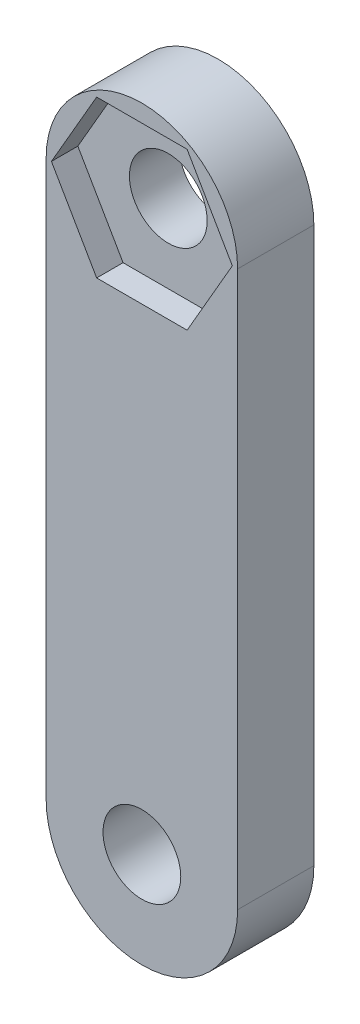
ISO-10303-21;
HEADER;
FILE_DESCRIPTION(('STEP AP214'),'2;1');
FILE_NAME('part.step','',(''),(''),'','','');
FILE_SCHEMA(('AUTOMOTIVE_DESIGN { 1 0 10303 214 1 1 1 1 }'));
ENDSEC;
DATA;
#1=APPLICATION_CONTEXT('core data for automotive mechanical design processes');
#2=APPLICATION_PROTOCOL_DEFINITION('international standard','automotive_design',2000,#1);
#3=PRODUCT_CONTEXT('',#1,'mechanical');
#4=PRODUCT('Part','Part','',(#3));
#5=PRODUCT_RELATED_PRODUCT_CATEGORY('part','',(#4));
#6=PRODUCT_DEFINITION_FORMATION('','',#4);
#7=PRODUCT_DEFINITION_CONTEXT('part definition',#1,'design');
#8=PRODUCT_DEFINITION('design','',#6,#7);
#9=PRODUCT_DEFINITION_SHAPE('','',#8);
#10=(LENGTH_UNIT() NAMED_UNIT(*) SI_UNIT(.MILLI.,.METRE.));
#11=(NAMED_UNIT(*) PLANE_ANGLE_UNIT() SI_UNIT($,.RADIAN.));
#12=(NAMED_UNIT(*) SI_UNIT($,.STERADIAN.) SOLID_ANGLE_UNIT());
#13=UNCERTAINTY_MEASURE_WITH_UNIT(LENGTH_MEASURE(1.E-05),#10,'distance_accuracy_value','');
#14=(GEOMETRIC_REPRESENTATION_CONTEXT(3) GLOBAL_UNCERTAINTY_ASSIGNED_CONTEXT((#13)) GLOBAL_UNIT_ASSIGNED_CONTEXT((#10,
#11,#12)) REPRESENTATION_CONTEXT('',''));
#15=CARTESIAN_POINT('',(0.,0.,0.));
#16=DIRECTION('',(0.,0.,1.));
#17=DIRECTION('',(1.,0.,0.));
#18=AXIS2_PLACEMENT_3D('',#15,#16,#17);
#19=CARTESIAN_POINT('',(0.,23.114,6.35));
#20=DIRECTION('',(0.,0.,-1.));
#21=DIRECTION('',(-1.,0.,0.));
#22=AXIS2_PLACEMENT_3D('',#19,#20,#21);
#23=CYLINDRICAL_SURFACE('',#22,3.2385);
#24=CARTESIAN_POINT('',(0.,23.114,0.));
#25=DIRECTION('',(0.,0.,1.));
#26=DIRECTION('',(1.,0.,0.));
#27=AXIS2_PLACEMENT_3D('',#24,#25,#26);
#28=CIRCLE('',#27,3.2385);
#29=CARTESIAN_POINT('',(3.23849999999999,23.114,0.));
#30=VERTEX_POINT('',#29);
#31=EDGE_CURVE('E180',#30,#30,#28,.T.);
#32=ORIENTED_EDGE('',*,*,#31,.F.);
#33=EDGE_LOOP('',(#32));
#34=FACE_BOUND('',#33,.T.);
#35=CARTESIAN_POINT('',(0.,23.114,4.15));
#36=DIRECTION('',(0.,0.,1.));
#37=DIRECTION('',(1.,0.,0.));
#38=AXIS2_PLACEMENT_3D('',#35,#36,#37);
#39=CIRCLE('',#38,3.2385);
#40=CARTESIAN_POINT('',(3.23849999999999,23.114,4.15));
#41=VERTEX_POINT('',#40);
#42=EDGE_CURVE('E40',#41,#41,#39,.T.);
#43=ORIENTED_EDGE('',*,*,#42,.T.);
#44=EDGE_LOOP('',(#43));
#45=FACE_BOUND('',#44,.T.);
#46=ADVANCED_FACE('F36',(#34,#45),#23,.F.);
#47=CARTESIAN_POINT('',(0.,23.114,6.35));
#48=DIRECTION('',(0.,0.,1.));
#49=DIRECTION('',(1.,0.,0.));
#50=AXIS2_PLACEMENT_3D('',#47,#48,#49);
#51=PLANE('',#50);
#52=DIRECTION('',(-0.5,-0.866025403784439,0.));
#53=VECTOR('',#52,1.);
#54=CARTESIAN_POINT('',(-3.76721050646232,29.639,6.35));
#55=LINE('',#54,#53);
#56=CARTESIAN_POINT('',(-3.76721050646232,29.639,6.35));
#57=VERTEX_POINT('',#56);
#58=CARTESIAN_POINT('',(-7.53442101292462,23.114,6.35));
#59=VERTEX_POINT('',#58);
#60=EDGE_CURVE('E52',#57,#59,#55,.T.);
#61=ORIENTED_EDGE('',*,*,#60,.F.);
#62=DIRECTION('',(-1.,0.,0.));
#63=VECTOR('',#62,1.);
#64=CARTESIAN_POINT('',(3.7672105064623,29.639,6.35));
#65=LINE('',#64,#63);
#66=CARTESIAN_POINT('',(3.7672105064623,29.639,6.35));
#67=VERTEX_POINT('',#66);
#68=EDGE_CURVE('E144',#67,#57,#65,.T.);
#69=ORIENTED_EDGE('',*,*,#68,.F.);
#70=DIRECTION('',(-0.5,0.866025403784439,0.));
#71=VECTOR('',#70,1.);
#72=CARTESIAN_POINT('',(7.53442101292461,23.114,6.35));
#73=LINE('',#72,#71);
#74=CARTESIAN_POINT('',(7.53442101292461,23.114,6.35));
#75=VERTEX_POINT('',#74);
#76=EDGE_CURVE('E147',#75,#67,#73,.T.);
#77=ORIENTED_EDGE('',*,*,#76,.F.);
#78=DIRECTION('',(0.5,0.866025403784439,0.));
#79=VECTOR('',#78,1.);
#80=CARTESIAN_POINT('',(3.7672105064623,16.589,6.35));
#81=LINE('',#80,#79);
#82=CARTESIAN_POINT('',(3.7672105064623,16.589,6.35));
#83=VERTEX_POINT('',#82);
#84=EDGE_CURVE('E163',#83,#75,#81,.T.);
#85=ORIENTED_EDGE('',*,*,#84,.F.);
#86=DIRECTION('',(1.,0.,0.));
#87=VECTOR('',#86,1.);
#88=CARTESIAN_POINT('',(-3.76721050646231,16.589,6.35));
#89=LINE('',#88,#87);
#90=CARTESIAN_POINT('',(-3.76721050646231,16.589,6.35));
#91=VERTEX_POINT('',#90);
#92=EDGE_CURVE('E160',#91,#83,#89,.T.);
#93=ORIENTED_EDGE('',*,*,#92,.F.);
#94=DIRECTION('',(0.5,-0.866025403784439,0.));
#95=VECTOR('',#94,1.);
#96=CARTESIAN_POINT('',(-7.53442101292462,23.114,6.35));
#97=LINE('',#96,#95);
#98=EDGE_CURVE('E158',#59,#91,#97,.T.);
#99=ORIENTED_EDGE('',*,*,#98,.F.);
#100=EDGE_LOOP('',(#61,#69,#77,#85,#93,#99));
#101=FACE_BOUND('',#100,.T.);
#102=CARTESIAN_POINT('',(0.,23.114,6.35));
#103=DIRECTION('',(0.,0.,1.));
#104=DIRECTION('',(1.,0.,0.));
#105=AXIS2_PLACEMENT_3D('',#102,#103,#104);
#106=CIRCLE('',#105,7.9756);
#107=CARTESIAN_POINT('',(7.97559999999999,23.114,6.35));
#108=VERTEX_POINT('',#107);
#109=CARTESIAN_POINT('',(-7.97560000000001,23.114,6.35));
#110=VERTEX_POINT('',#109);
#111=EDGE_CURVE('E187',#108,#110,#106,.T.);
#112=ORIENTED_EDGE('',*,*,#111,.T.);
#113=DIRECTION('',(0.,-1.,0.));
#114=VECTOR('',#113,1.);
#115=CARTESIAN_POINT('',(-7.97560000000001,23.114,6.35));
#116=LINE('',#115,#114);
#117=CARTESIAN_POINT('',(-7.97559999999999,-23.114,6.35));
#118=VERTEX_POINT('',#117);
#119=EDGE_CURVE('E89',#110,#118,#116,.T.);
#120=ORIENTED_EDGE('',*,*,#119,.T.);
#121=CARTESIAN_POINT('',(0.,-23.114,6.35));
#122=DIRECTION('',(0.,0.,1.));
#123=DIRECTION('',(1.,0.,0.));
#124=AXIS2_PLACEMENT_3D('',#121,#122,#123);
#125=CIRCLE('',#124,7.9756);
#126=CARTESIAN_POINT('',(7.97560000000001,-23.114,6.35));
#127=VERTEX_POINT('',#126);
#128=EDGE_CURVE('E190',#118,#127,#125,.T.);
#129=ORIENTED_EDGE('',*,*,#128,.T.);
#130=DIRECTION('',(0.,1.,0.));
#131=VECTOR('',#130,1.);
#132=CARTESIAN_POINT('',(7.97559999999999,23.114,6.35));
#133=LINE('',#132,#131);
#134=EDGE_CURVE('E61',#127,#108,#133,.T.);
#135=ORIENTED_EDGE('',*,*,#134,.T.);
#136=EDGE_LOOP('',(#112,#120,#129,#135));
#137=FACE_BOUND('',#136,.T.);
#138=CARTESIAN_POINT('',(0.,-23.114,6.35));
#139=DIRECTION('',(0.,0.,1.));
#140=DIRECTION('',(1.,0.,0.));
#141=AXIS2_PLACEMENT_3D('',#138,#139,#140);
#142=CIRCLE('',#141,3.2385);
#143=CARTESIAN_POINT('',(3.23850000000001,-23.114,6.35));
#144=VERTEX_POINT('',#143);
#145=EDGE_CURVE('E177',#144,#144,#142,.T.);
#146=ORIENTED_EDGE('',*,*,#145,.F.);
#147=EDGE_LOOP('',(#146));
#148=FACE_BOUND('',#147,.T.);
#149=ADVANCED_FACE('F231',(#101,#137,#148),#51,.T.);
#150=CARTESIAN_POINT('',(0.,23.114,0.));
#151=DIRECTION('',(0.,0.,1.));
#152=DIRECTION('',(1.,0.,0.));
#153=AXIS2_PLACEMENT_3D('',#150,#151,#152);
#154=PLANE('',#153);
#155=CARTESIAN_POINT('',(0.,23.114,0.));
#156=DIRECTION('',(0.,0.,1.));
#157=DIRECTION('',(1.,0.,0.));
#158=AXIS2_PLACEMENT_3D('',#155,#156,#157);
#159=CIRCLE('',#158,7.9756);
#160=CARTESIAN_POINT('',(7.97559999999999,23.114,0.));
#161=VERTEX_POINT('',#160);
#162=CARTESIAN_POINT('',(-7.97560000000001,23.114,0.));
#163=VERTEX_POINT('',#162);
#164=EDGE_CURVE('E186',#161,#163,#159,.T.);
#165=ORIENTED_EDGE('',*,*,#164,.F.);
#166=DIRECTION('',(0.,1.,0.));
#167=VECTOR('',#166,1.);
#168=CARTESIAN_POINT('',(7.97559999999999,23.114,0.));
#169=LINE('',#168,#167);
#170=CARTESIAN_POINT('',(7.97560000000001,-23.114,0.));
#171=VERTEX_POINT('',#170);
#172=EDGE_CURVE('E82',#171,#161,#169,.T.);
#173=ORIENTED_EDGE('',*,*,#172,.F.);
#174=CARTESIAN_POINT('',(0.,-23.114,0.));
#175=DIRECTION('',(0.,0.,1.));
#176=DIRECTION('',(1.,0.,0.));
#177=AXIS2_PLACEMENT_3D('',#174,#175,#176);
#178=CIRCLE('',#177,7.9756);
#179=CARTESIAN_POINT('',(-7.97559999999999,-23.114,0.));
#180=VERTEX_POINT('',#179);
#181=EDGE_CURVE('E198',#180,#171,#178,.T.);
#182=ORIENTED_EDGE('',*,*,#181,.F.);
#183=DIRECTION('',(0.,-1.,0.));
#184=VECTOR('',#183,1.);
#185=CARTESIAN_POINT('',(-7.97560000000001,23.114,0.));
#186=LINE('',#185,#184);
#187=EDGE_CURVE('E196',#163,#180,#186,.T.);
#188=ORIENTED_EDGE('',*,*,#187,.F.);
#189=EDGE_LOOP('',(#165,#173,#182,#188));
#190=FACE_BOUND('',#189,.T.);
#191=ORIENTED_EDGE('',*,*,#31,.T.);
#192=EDGE_LOOP('',(#191));
#193=FACE_BOUND('',#192,.T.);
#194=CARTESIAN_POINT('',(0.,-23.114,0.));
#195=DIRECTION('',(0.,0.,1.));
#196=DIRECTION('',(1.,0.,0.));
#197=AXIS2_PLACEMENT_3D('',#194,#195,#196);
#198=CIRCLE('',#197,3.2385);
#199=CARTESIAN_POINT('',(3.23850000000001,-23.114,0.));
#200=VERTEX_POINT('',#199);
#201=EDGE_CURVE('E181',#200,#200,#198,.T.);
#202=ORIENTED_EDGE('',*,*,#201,.T.);
#203=EDGE_LOOP('',(#202));
#204=FACE_BOUND('',#203,.T.);
#205=ADVANCED_FACE('F212',(#190,#193,#204),#154,.F.);
#206=CARTESIAN_POINT('',(0.,23.114,6.35));
#207=DIRECTION('',(0.,0.,-1.));
#208=DIRECTION('',(-1.,0.,0.));
#209=AXIS2_PLACEMENT_3D('',#206,#207,#208);
#210=CYLINDRICAL_SURFACE('',#209,7.9756);
#211=ORIENTED_EDGE('',*,*,#164,.T.);
#212=DIRECTION('',(0.,0.,-1.));
#213=VECTOR('',#212,1.);
#214=CARTESIAN_POINT('',(-7.97560000000001,23.114,6.35));
#215=LINE('',#214,#213);
#216=EDGE_CURVE('E11',#110,#163,#215,.T.);
#217=ORIENTED_EDGE('',*,*,#216,.F.);
#218=ORIENTED_EDGE('',*,*,#111,.F.);
#219=DIRECTION('',(0.,0.,-1.));
#220=VECTOR('',#219,1.);
#221=CARTESIAN_POINT('',(7.97559999999999,23.114,6.35));
#222=LINE('',#221,#220);
#223=EDGE_CURVE('E193',#108,#161,#222,.T.);
#224=ORIENTED_EDGE('',*,*,#223,.T.);
#225=EDGE_LOOP('',(#211,#217,#218,#224));
#226=FACE_BOUND('',#225,.T.);
#227=ADVANCED_FACE('F38',(#226),#210,.T.);
#228=CARTESIAN_POINT('',(-7.97560000000001,23.114,6.35));
#229=DIRECTION('',(1.,0.,0.));
#230=DIRECTION('',(0.,1.,0.));
#231=AXIS2_PLACEMENT_3D('',#228,#229,#230);
#232=PLANE('',#231);
#233=ORIENTED_EDGE('',*,*,#187,.T.);
#234=DIRECTION('',(0.,0.,-1.));
#235=VECTOR('',#234,1.);
#236=CARTESIAN_POINT('',(-7.97559999999999,-23.114,6.35));
#237=LINE('',#236,#235);
#238=EDGE_CURVE('E45',#118,#180,#237,.T.);
#239=ORIENTED_EDGE('',*,*,#238,.F.);
#240=ORIENTED_EDGE('',*,*,#119,.F.);
#241=ORIENTED_EDGE('',*,*,#216,.T.);
#242=EDGE_LOOP('',(#233,#239,#240,#241));
#243=FACE_BOUND('',#242,.T.);
#244=ADVANCED_FACE('F227',(#243),#232,.F.);
#245=CARTESIAN_POINT('',(0.,-23.114,6.35));
#246=DIRECTION('',(0.,0.,-1.));
#247=DIRECTION('',(-1.,0.,0.));
#248=AXIS2_PLACEMENT_3D('',#245,#246,#247);
#249=CYLINDRICAL_SURFACE('',#248,7.9756);
#250=ORIENTED_EDGE('',*,*,#181,.T.);
#251=DIRECTION('',(0.,0.,-1.));
#252=VECTOR('',#251,1.);
#253=CARTESIAN_POINT('',(7.97560000000001,-23.114,6.35));
#254=LINE('',#253,#252);
#255=EDGE_CURVE('E202',#127,#171,#254,.T.);
#256=ORIENTED_EDGE('',*,*,#255,.F.);
#257=ORIENTED_EDGE('',*,*,#128,.F.);
#258=ORIENTED_EDGE('',*,*,#238,.T.);
#259=EDGE_LOOP('',(#250,#256,#257,#258));
#260=FACE_BOUND('',#259,.T.);
#261=ADVANCED_FACE('F208',(#260),#249,.T.);
#262=CARTESIAN_POINT('',(7.97559999999999,23.114,6.35));
#263=DIRECTION('',(-1.,0.,0.));
#264=DIRECTION('',(0.,-1.,0.));
#265=AXIS2_PLACEMENT_3D('',#262,#263,#264);
#266=PLANE('',#265);
#267=ORIENTED_EDGE('',*,*,#172,.T.);
#268=ORIENTED_EDGE('',*,*,#223,.F.);
#269=ORIENTED_EDGE('',*,*,#134,.F.);
#270=ORIENTED_EDGE('',*,*,#255,.T.);
#271=EDGE_LOOP('',(#267,#268,#269,#270));
#272=FACE_BOUND('',#271,.T.);
#273=ADVANCED_FACE('F217',(#272),#266,.F.);
#274=CARTESIAN_POINT('',(0.,-23.114,6.35));
#275=DIRECTION('',(0.,0.,-1.));
#276=DIRECTION('',(-1.,0.,0.));
#277=AXIS2_PLACEMENT_3D('',#274,#275,#276);
#278=CYLINDRICAL_SURFACE('',#277,3.2385);
#279=ORIENTED_EDGE('',*,*,#145,.T.);
#280=EDGE_LOOP('',(#279));
#281=FACE_BOUND('',#280,.T.);
#282=ORIENTED_EDGE('',*,*,#201,.F.);
#283=EDGE_LOOP('',(#282));
#284=FACE_BOUND('',#283,.T.);
#285=ADVANCED_FACE('F219',(#281,#284),#278,.F.);
#286=CARTESIAN_POINT('',(-3.76721050646232,29.639,4.15));
#287=DIRECTION('',(-0.866025403784439,0.5,0.));
#288=DIRECTION('',(-0.5,-0.866025403784439,0.));
#289=AXIS2_PLACEMENT_3D('',#286,#287,#288);
#290=PLANE('',#289);
#291=ORIENTED_EDGE('',*,*,#60,.T.);
#292=DIRECTION('',(0.,0.,1.));
#293=VECTOR('',#292,1.);
#294=CARTESIAN_POINT('',(-7.53442101292462,23.114,4.15));
#295=LINE('',#294,#293);
#296=CARTESIAN_POINT('',(-7.53442101292462,23.114,4.15));
#297=VERTEX_POINT('',#296);
#298=EDGE_CURVE('E121',#297,#59,#295,.T.);
#299=ORIENTED_EDGE('',*,*,#298,.F.);
#300=DIRECTION('',(-0.5,-0.866025403784439,0.));
#301=VECTOR('',#300,1.);
#302=CARTESIAN_POINT('',(-3.76721050646232,29.639,4.15));
#303=LINE('',#302,#301);
#304=CARTESIAN_POINT('',(-3.76721050646232,29.639,4.15));
#305=VERTEX_POINT('',#304);
#306=EDGE_CURVE('E125',#305,#297,#303,.T.);
#307=ORIENTED_EDGE('',*,*,#306,.F.);
#308=DIRECTION('',(0.,0.,1.));
#309=VECTOR('',#308,1.);
#310=CARTESIAN_POINT('',(-3.76721050646232,29.639,4.15));
#311=LINE('',#310,#309);
#312=EDGE_CURVE('E168',#305,#57,#311,.T.);
#313=ORIENTED_EDGE('',*,*,#312,.T.);
#314=EDGE_LOOP('',(#291,#299,#307,#313));
#315=FACE_BOUND('',#314,.T.);
#316=ADVANCED_FACE('F123',(#315),#290,.F.);
#317=CARTESIAN_POINT('',(3.7672105064623,29.639,4.15));
#318=DIRECTION('',(0.,1.,0.));
#319=DIRECTION('',(0.,0.,1.));
#320=AXIS2_PLACEMENT_3D('',#317,#318,#319);
#321=PLANE('',#320);
#322=ORIENTED_EDGE('',*,*,#68,.T.);
#323=ORIENTED_EDGE('',*,*,#312,.F.);
#324=DIRECTION('',(-1.,0.,0.));
#325=VECTOR('',#324,1.);
#326=CARTESIAN_POINT('',(3.7672105064623,29.639,4.15));
#327=LINE('',#326,#325);
#328=CARTESIAN_POINT('',(3.7672105064623,29.639,4.15));
#329=VERTEX_POINT('',#328);
#330=EDGE_CURVE('E131',#329,#305,#327,.T.);
#331=ORIENTED_EDGE('',*,*,#330,.F.);
#332=DIRECTION('',(0.,0.,1.));
#333=VECTOR('',#332,1.);
#334=CARTESIAN_POINT('',(3.7672105064623,29.639,4.15));
#335=LINE('',#334,#333);
#336=EDGE_CURVE('E170',#329,#67,#335,.T.);
#337=ORIENTED_EDGE('',*,*,#336,.T.);
#338=EDGE_LOOP('',(#322,#323,#331,#337));
#339=FACE_BOUND('',#338,.T.);
#340=ADVANCED_FACE('F279',(#339),#321,.F.);
#341=CARTESIAN_POINT('',(7.53442101292461,23.114,4.15));
#342=DIRECTION('',(0.866025403784439,0.5,0.));
#343=DIRECTION('',(-0.5,0.866025403784439,0.));
#344=AXIS2_PLACEMENT_3D('',#341,#342,#343);
#345=PLANE('',#344);
#346=ORIENTED_EDGE('',*,*,#76,.T.);
#347=ORIENTED_EDGE('',*,*,#336,.F.);
#348=DIRECTION('',(-0.5,0.866025403784439,0.));
#349=VECTOR('',#348,1.);
#350=CARTESIAN_POINT('',(7.53442101292461,23.114,4.15));
#351=LINE('',#350,#349);
#352=CARTESIAN_POINT('',(7.53442101292461,23.114,4.15));
#353=VERTEX_POINT('',#352);
#354=EDGE_CURVE('E154',#353,#329,#351,.T.);
#355=ORIENTED_EDGE('',*,*,#354,.F.);
#356=DIRECTION('',(0.,0.,1.));
#357=VECTOR('',#356,1.);
#358=CARTESIAN_POINT('',(7.53442101292461,23.114,4.15));
#359=LINE('',#358,#357);
#360=EDGE_CURVE('E172',#353,#75,#359,.T.);
#361=ORIENTED_EDGE('',*,*,#360,.T.);
#362=EDGE_LOOP('',(#346,#347,#355,#361));
#363=FACE_BOUND('',#362,.T.);
#364=ADVANCED_FACE('F284',(#363),#345,.F.);
#365=CARTESIAN_POINT('',(3.7672105064623,16.589,4.15));
#366=DIRECTION('',(0.866025403784439,-0.5,0.));
#367=DIRECTION('',(0.5,0.866025403784439,0.));
#368=AXIS2_PLACEMENT_3D('',#365,#366,#367);
#369=PLANE('',#368);
#370=ORIENTED_EDGE('',*,*,#84,.T.);
#371=ORIENTED_EDGE('',*,*,#360,.F.);
#372=DIRECTION('',(0.5,0.866025403784439,0.));
#373=VECTOR('',#372,1.);
#374=CARTESIAN_POINT('',(3.7672105064623,16.589,4.15));
#375=LINE('',#374,#373);
#376=CARTESIAN_POINT('',(3.7672105064623,16.589,4.15));
#377=VERTEX_POINT('',#376);
#378=EDGE_CURVE('E151',#377,#353,#375,.T.);
#379=ORIENTED_EDGE('',*,*,#378,.F.);
#380=DIRECTION('',(0.,0.,1.));
#381=VECTOR('',#380,1.);
#382=CARTESIAN_POINT('',(3.7672105064623,16.589,4.15));
#383=LINE('',#382,#381);
#384=EDGE_CURVE('E174',#377,#83,#383,.T.);
#385=ORIENTED_EDGE('',*,*,#384,.T.);
#386=EDGE_LOOP('',(#370,#371,#379,#385));
#387=FACE_BOUND('',#386,.T.);
#388=ADVANCED_FACE('F292',(#387),#369,.F.);
#389=CARTESIAN_POINT('',(-3.76721050646231,16.589,4.15));
#390=DIRECTION('',(0.,-1.,0.));
#391=DIRECTION('',(0.,0.,-1.));
#392=AXIS2_PLACEMENT_3D('',#389,#390,#391);
#393=PLANE('',#392);
#394=ORIENTED_EDGE('',*,*,#92,.T.);
#395=ORIENTED_EDGE('',*,*,#384,.F.);
#396=DIRECTION('',(1.,0.,0.));
#397=VECTOR('',#396,1.);
#398=CARTESIAN_POINT('',(-3.76721050646231,16.589,4.15));
#399=LINE('',#398,#397);
#400=CARTESIAN_POINT('',(-3.76721050646231,16.589,4.15));
#401=VERTEX_POINT('',#400);
#402=EDGE_CURVE('E139',#401,#377,#399,.T.);
#403=ORIENTED_EDGE('',*,*,#402,.F.);
#404=DIRECTION('',(0.,0.,1.));
#405=VECTOR('',#404,1.);
#406=CARTESIAN_POINT('',(-3.76721050646231,16.589,4.15));
#407=LINE('',#406,#405);
#408=EDGE_CURVE('E130',#401,#91,#407,.T.);
#409=ORIENTED_EDGE('',*,*,#408,.T.);
#410=EDGE_LOOP('',(#394,#395,#403,#409));
#411=FACE_BOUND('',#410,.T.);
#412=ADVANCED_FACE('F300',(#411),#393,.F.);
#413=CARTESIAN_POINT('',(-7.53442101292462,23.114,4.15));
#414=DIRECTION('',(-0.866025403784439,-0.5,0.));
#415=DIRECTION('',(0.5,-0.866025403784439,0.));
#416=AXIS2_PLACEMENT_3D('',#413,#414,#415);
#417=PLANE('',#416);
#418=ORIENTED_EDGE('',*,*,#98,.T.);
#419=ORIENTED_EDGE('',*,*,#408,.F.);
#420=DIRECTION('',(0.5,-0.866025403784439,0.));
#421=VECTOR('',#420,1.);
#422=CARTESIAN_POINT('',(-7.53442101292462,23.114,4.15));
#423=LINE('',#422,#421);
#424=EDGE_CURVE('E134',#297,#401,#423,.T.);
#425=ORIENTED_EDGE('',*,*,#424,.F.);
#426=ORIENTED_EDGE('',*,*,#298,.T.);
#427=EDGE_LOOP('',(#418,#419,#425,#426));
#428=FACE_BOUND('',#427,.T.);
#429=ADVANCED_FACE('F135',(#428),#417,.F.);
#430=CARTESIAN_POINT('',(0.,0.,4.15));
#431=DIRECTION('',(0.,0.,1.));
#432=DIRECTION('',(1.,0.,0.));
#433=AXIS2_PLACEMENT_3D('',#430,#431,#432);
#434=PLANE('',#433);
#435=ORIENTED_EDGE('',*,*,#42,.F.);
#436=EDGE_LOOP('',(#435));
#437=FACE_BOUND('',#436,.T.);
#438=ORIENTED_EDGE('',*,*,#306,.T.);
#439=ORIENTED_EDGE('',*,*,#424,.T.);
#440=ORIENTED_EDGE('',*,*,#402,.T.);
#441=ORIENTED_EDGE('',*,*,#378,.T.);
#442=ORIENTED_EDGE('',*,*,#354,.T.);
#443=ORIENTED_EDGE('',*,*,#330,.T.);
#444=EDGE_LOOP('',(#438,#439,#440,#441,#442,#443));
#445=FACE_BOUND('',#444,.T.);
#446=ADVANCED_FACE('F141',(#437,#445),#434,.T.);
#447=CLOSED_SHELL('',(#46,#149,#205,#227,#244,#261,#273,#285,#316,#340,#364,#388,#412,#429,#446));
#448=MANIFOLD_SOLID_BREP('B2',#447);
#449=ADVANCED_BREP_SHAPE_REPRESENTATION('',(#18,#448),#14);
#450=SHAPE_DEFINITION_REPRESENTATION(#9,#449);
ENDSEC;
END-ISO-10303-21;
